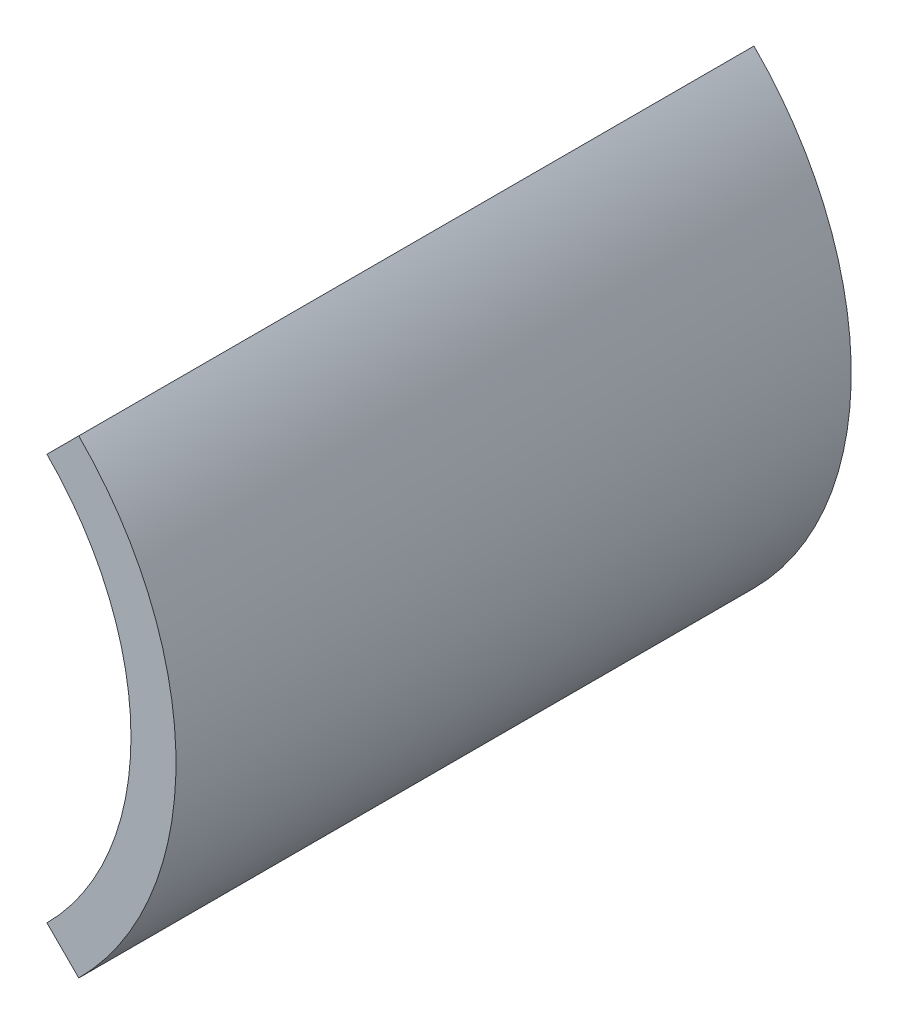
ISO-10303-21;
HEADER;
FILE_DESCRIPTION(('STEP AP214'),'2;1');
FILE_NAME('part.step','',(''),(''),'','','');
FILE_SCHEMA(('AUTOMOTIVE_DESIGN { 1 0 10303 214 1 1 1 1 }'));
ENDSEC;
DATA;
#1=APPLICATION_CONTEXT('core data for automotive mechanical design processes');
#2=APPLICATION_PROTOCOL_DEFINITION('international standard','automotive_design',2000,#1);
#3=PRODUCT_CONTEXT('',#1,'mechanical');
#4=PRODUCT('Part','Part','',(#3));
#5=PRODUCT_RELATED_PRODUCT_CATEGORY('part','',(#4));
#6=PRODUCT_DEFINITION_FORMATION('','',#4);
#7=PRODUCT_DEFINITION_CONTEXT('part definition',#1,'design');
#8=PRODUCT_DEFINITION('design','',#6,#7);
#9=PRODUCT_DEFINITION_SHAPE('','',#8);
#10=(LENGTH_UNIT() NAMED_UNIT(*) SI_UNIT(.MILLI.,.METRE.));
#11=(NAMED_UNIT(*) PLANE_ANGLE_UNIT() SI_UNIT($,.RADIAN.));
#12=(NAMED_UNIT(*) SI_UNIT($,.STERADIAN.) SOLID_ANGLE_UNIT());
#13=UNCERTAINTY_MEASURE_WITH_UNIT(LENGTH_MEASURE(1.E-05),#10,'distance_accuracy_value','');
#14=(GEOMETRIC_REPRESENTATION_CONTEXT(3) GLOBAL_UNCERTAINTY_ASSIGNED_CONTEXT((#13)) GLOBAL_UNIT_ASSIGNED_CONTEXT((#10,
#11,#12)) REPRESENTATION_CONTEXT('',''));
#15=CARTESIAN_POINT('',(0.,0.,0.));
#16=DIRECTION('',(0.,0.,1.));
#17=DIRECTION('',(1.,0.,0.));
#18=AXIS2_PLACEMENT_3D('',#15,#16,#17);
#19=CARTESIAN_POINT('',(0.,0.,15.));
#20=DIRECTION('',(0.,0.,-1.));
#21=DIRECTION('',(-1.,0.,0.));
#22=AXIS2_PLACEMENT_3D('',#19,#20,#21);
#23=CYLINDRICAL_SURFACE('',#22,12.75);
#24=CARTESIAN_POINT('',(0.,0.,-15.));
#25=DIRECTION('',(0.,0.,-1.));
#26=DIRECTION('',(1.,0.,0.));
#27=AXIS2_PLACEMENT_3D('',#24,#25,#26);
#28=CIRCLE('',#27,12.75);
#29=CARTESIAN_POINT('',(9.01561146012845,9.01561146012851,-15.));
#30=VERTEX_POINT('',#29);
#31=CARTESIAN_POINT('',(9.01561146012846,-9.0156114601285,-15.));
#32=VERTEX_POINT('',#31);
#33=EDGE_CURVE('E104',#30,#32,#28,.T.);
#34=ORIENTED_EDGE('',*,*,#33,.T.);
#35=DIRECTION('',(0.,0.,-1.));
#36=VECTOR('',#35,1.);
#37=CARTESIAN_POINT('',(9.01561146012846,-9.0156114601285,15.));
#38=LINE('',#37,#36);
#39=CARTESIAN_POINT('',(9.01561146012846,-9.0156114601285,15.));
#40=VERTEX_POINT('',#39);
#41=EDGE_CURVE('E11',#40,#32,#38,.T.);
#42=ORIENTED_EDGE('',*,*,#41,.F.);
#43=CARTESIAN_POINT('',(0.,0.,15.));
#44=DIRECTION('',(0.,0.,-1.));
#45=DIRECTION('',(1.,0.,0.));
#46=AXIS2_PLACEMENT_3D('',#43,#44,#45);
#47=CIRCLE('',#46,12.75);
#48=CARTESIAN_POINT('',(9.01561146012845,9.01561146012851,15.));
#49=VERTEX_POINT('',#48);
#50=EDGE_CURVE('E92',#49,#40,#47,.T.);
#51=ORIENTED_EDGE('',*,*,#50,.F.);
#52=DIRECTION('',(0.,0.,-1.));
#53=VECTOR('',#52,1.);
#54=CARTESIAN_POINT('',(9.01561146012845,9.01561146012851,15.));
#55=LINE('',#54,#53);
#56=EDGE_CURVE('E100',#49,#30,#55,.T.);
#57=ORIENTED_EDGE('',*,*,#56,.T.);
#58=EDGE_LOOP('',(#34,#42,#51,#57));
#59=FACE_BOUND('',#58,.T.);
#60=ADVANCED_FACE('F41',(#59),#23,.F.);
#61=CARTESIAN_POINT('',(9.01561146012846,-9.0156114601285,15.));
#62=DIRECTION('',(0.707106781186548,0.707106781186547,0.));
#63=DIRECTION('',(-0.707106781186547,0.707106781186548,0.));
#64=AXIS2_PLACEMENT_3D('',#61,#62,#63);
#65=PLANE('',#64);
#66=DIRECTION('',(0.707106781186547,-0.707106781186548,0.));
#67=VECTOR('',#66,1.);
#68=CARTESIAN_POINT('',(9.01561146012846,-9.0156114601285,-15.));
#69=LINE('',#68,#67);
#70=CARTESIAN_POINT('',(10.4298250225016,-10.4298250225016,-15.));
#71=VERTEX_POINT('',#70);
#72=EDGE_CURVE('E96',#32,#71,#69,.T.);
#73=ORIENTED_EDGE('',*,*,#72,.T.);
#74=DIRECTION('',(0.,0.,-1.));
#75=VECTOR('',#74,1.);
#76=CARTESIAN_POINT('',(10.4298250225016,-10.4298250225016,15.));
#77=LINE('',#76,#75);
#78=CARTESIAN_POINT('',(10.4298250225016,-10.4298250225016,15.));
#79=VERTEX_POINT('',#78);
#80=EDGE_CURVE('E49',#79,#71,#77,.T.);
#81=ORIENTED_EDGE('',*,*,#80,.F.);
#82=DIRECTION('',(0.707106781186547,-0.707106781186548,0.));
#83=VECTOR('',#82,1.);
#84=CARTESIAN_POINT('',(9.01561146012846,-9.0156114601285,15.));
#85=LINE('',#84,#83);
#86=EDGE_CURVE('E87',#40,#79,#85,.T.);
#87=ORIENTED_EDGE('',*,*,#86,.F.);
#88=ORIENTED_EDGE('',*,*,#41,.T.);
#89=EDGE_LOOP('',(#73,#81,#87,#88));
#90=FACE_BOUND('',#89,.T.);
#91=ADVANCED_FACE('F95',(#90),#65,.F.);
#92=CARTESIAN_POINT('',(0.,0.,15.));
#93=DIRECTION('',(0.,0.,-1.));
#94=DIRECTION('',(-1.,0.,0.));
#95=AXIS2_PLACEMENT_3D('',#92,#93,#94);
#96=CYLINDRICAL_SURFACE('',#95,14.75);
#97=CARTESIAN_POINT('',(0.,0.,-15.));
#98=DIRECTION('',(0.,0.,1.));
#99=DIRECTION('',(1.,0.,0.));
#100=AXIS2_PLACEMENT_3D('',#97,#98,#99);
#101=CIRCLE('',#100,14.75);
#102=CARTESIAN_POINT('',(10.4298250225015,10.4298250225016,-15.));
#103=VERTEX_POINT('',#102);
#104=EDGE_CURVE('E74',#71,#103,#101,.T.);
#105=ORIENTED_EDGE('',*,*,#104,.T.);
#106=DIRECTION('',(0.,0.,-1.));
#107=VECTOR('',#106,1.);
#108=CARTESIAN_POINT('',(10.4298250225015,10.4298250225016,15.));
#109=LINE('',#108,#107);
#110=CARTESIAN_POINT('',(10.4298250225015,10.4298250225016,15.));
#111=VERTEX_POINT('',#110);
#112=EDGE_CURVE('E97',#111,#103,#109,.T.);
#113=ORIENTED_EDGE('',*,*,#112,.F.);
#114=CARTESIAN_POINT('',(0.,0.,15.));
#115=DIRECTION('',(0.,0.,1.));
#116=DIRECTION('',(1.,0.,0.));
#117=AXIS2_PLACEMENT_3D('',#114,#115,#116);
#118=CIRCLE('',#117,14.75);
#119=EDGE_CURVE('E90',#79,#111,#118,.T.);
#120=ORIENTED_EDGE('',*,*,#119,.F.);
#121=ORIENTED_EDGE('',*,*,#80,.T.);
#122=EDGE_LOOP('',(#105,#113,#120,#121));
#123=FACE_BOUND('',#122,.T.);
#124=ADVANCED_FACE('F98',(#123),#96,.T.);
#125=CARTESIAN_POINT('',(9.01561146012845,9.01561146012851,15.));
#126=DIRECTION('',(0.70710678118655,-0.707106781186545,0.));
#127=DIRECTION('',(0.707106781186545,0.70710678118655,0.));
#128=AXIS2_PLACEMENT_3D('',#125,#126,#127);
#129=PLANE('',#128);
#130=DIRECTION('',(-0.707106781186545,-0.70710678118655,0.));
#131=VECTOR('',#130,1.);
#132=CARTESIAN_POINT('',(9.01561146012845,9.01561146012851,-15.));
#133=LINE('',#132,#131);
#134=EDGE_CURVE('E80',#103,#30,#133,.T.);
#135=ORIENTED_EDGE('',*,*,#134,.T.);
#136=ORIENTED_EDGE('',*,*,#56,.F.);
#137=DIRECTION('',(-0.707106781186545,-0.70710678118655,0.));
#138=VECTOR('',#137,1.);
#139=CARTESIAN_POINT('',(9.01561146012845,9.01561146012851,15.));
#140=LINE('',#139,#138);
#141=EDGE_CURVE('E57',#111,#49,#140,.T.);
#142=ORIENTED_EDGE('',*,*,#141,.F.);
#143=ORIENTED_EDGE('',*,*,#112,.T.);
#144=EDGE_LOOP('',(#135,#136,#142,#143));
#145=FACE_BOUND('',#144,.T.);
#146=ADVANCED_FACE('F111',(#145),#129,.F.);
#147=CARTESIAN_POINT('',(0.,0.,15.));
#148=DIRECTION('',(0.,0.,1.));
#149=DIRECTION('',(1.,0.,0.));
#150=AXIS2_PLACEMENT_3D('',#147,#148,#149);
#151=PLANE('',#150);
#152=ORIENTED_EDGE('',*,*,#50,.T.);
#153=ORIENTED_EDGE('',*,*,#86,.T.);
#154=ORIENTED_EDGE('',*,*,#119,.T.);
#155=ORIENTED_EDGE('',*,*,#141,.T.);
#156=EDGE_LOOP('',(#152,#153,#154,#155));
#157=FACE_BOUND('',#156,.T.);
#158=ADVANCED_FACE('F88',(#157),#151,.T.);
#159=CARTESIAN_POINT('',(0.,0.,-15.));
#160=DIRECTION('',(0.,0.,1.));
#161=DIRECTION('',(1.,0.,0.));
#162=AXIS2_PLACEMENT_3D('',#159,#160,#161);
#163=PLANE('',#162);
#164=ORIENTED_EDGE('',*,*,#33,.F.);
#165=ORIENTED_EDGE('',*,*,#134,.F.);
#166=ORIENTED_EDGE('',*,*,#104,.F.);
#167=ORIENTED_EDGE('',*,*,#72,.F.);
#168=EDGE_LOOP('',(#164,#165,#166,#167));
#169=FACE_BOUND('',#168,.T.);
#170=ADVANCED_FACE('F114',(#169),#163,.F.);
#171=CLOSED_SHELL('',(#60,#91,#124,#146,#158,#170));
#172=MANIFOLD_SOLID_BREP('B2',#171);
#173=ADVANCED_BREP_SHAPE_REPRESENTATION('',(#18,#172),#14);
#174=SHAPE_DEFINITION_REPRESENTATION(#9,#173);
ENDSEC;
END-ISO-10303-21;
